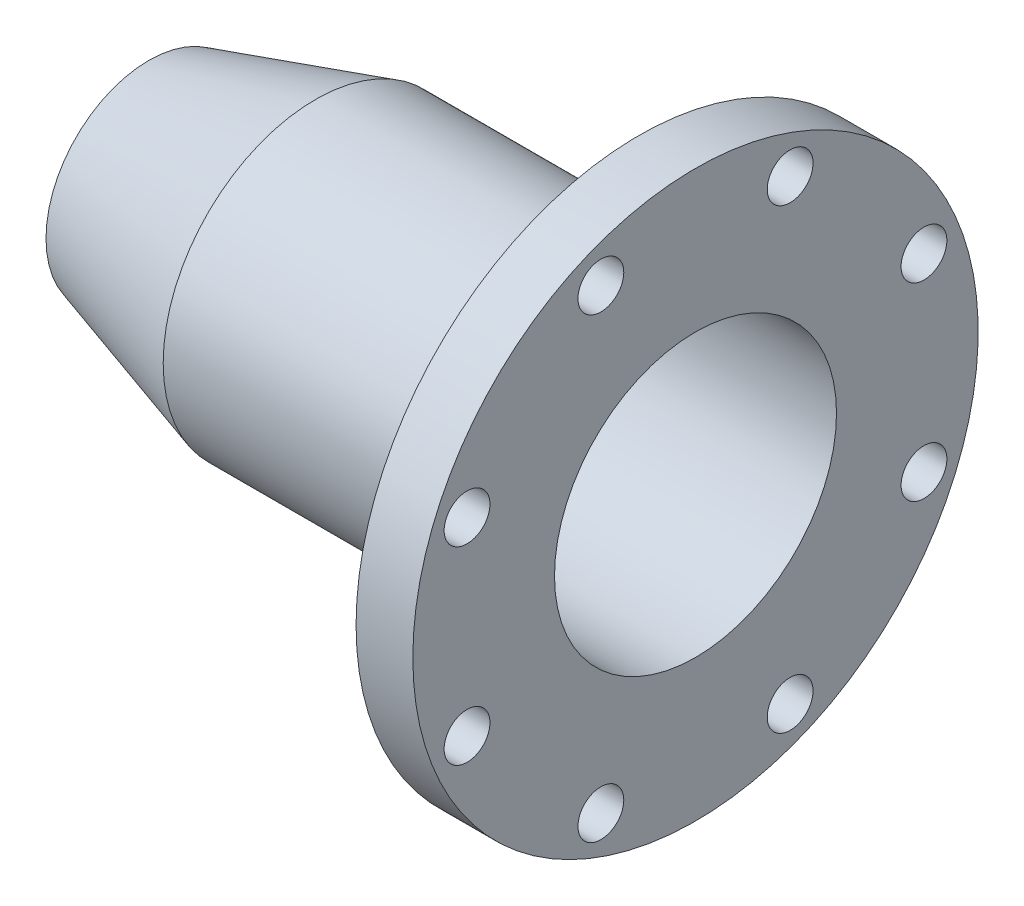
ISO-10303-21;
HEADER;
FILE_DESCRIPTION(('STEP AP214'),'2;1');
FILE_NAME('part.step','',(''),(''),'','','');
FILE_SCHEMA(('AUTOMOTIVE_DESIGN { 1 0 10303 214 1 1 1 1 }'));
ENDSEC;
DATA;
#1=APPLICATION_CONTEXT('core data for automotive mechanical design processes');
#2=APPLICATION_PROTOCOL_DEFINITION('international standard','automotive_design',2000,#1);
#3=PRODUCT_CONTEXT('',#1,'mechanical');
#4=PRODUCT('Part','Part','',(#3));
#5=PRODUCT_RELATED_PRODUCT_CATEGORY('part','',(#4));
#6=PRODUCT_DEFINITION_FORMATION('','',#4);
#7=PRODUCT_DEFINITION_CONTEXT('part definition',#1,'design');
#8=PRODUCT_DEFINITION('design','',#6,#7);
#9=PRODUCT_DEFINITION_SHAPE('','',#8);
#10=(LENGTH_UNIT() NAMED_UNIT(*) SI_UNIT(.MILLI.,.METRE.));
#11=(NAMED_UNIT(*) PLANE_ANGLE_UNIT() SI_UNIT($,.RADIAN.));
#12=(NAMED_UNIT(*) SI_UNIT($,.STERADIAN.) SOLID_ANGLE_UNIT());
#13=UNCERTAINTY_MEASURE_WITH_UNIT(LENGTH_MEASURE(1.E-05),#10,'distance_accuracy_value','');
#14=(GEOMETRIC_REPRESENTATION_CONTEXT(3) GLOBAL_UNCERTAINTY_ASSIGNED_CONTEXT((#13)) GLOBAL_UNIT_ASSIGNED_CONTEXT((#10,
#11,#12)) REPRESENTATION_CONTEXT('',''));
#15=CARTESIAN_POINT('',(0.,0.,0.));
#16=DIRECTION('',(0.,0.,1.));
#17=DIRECTION('',(1.,0.,0.));
#18=AXIS2_PLACEMENT_3D('',#15,#16,#17);
#19=CARTESIAN_POINT('',(0.,0.,0.));
#20=DIRECTION('',(-1.,0.,0.));
#21=DIRECTION('',(0.,0.,1.));
#22=AXIS2_PLACEMENT_3D('',#19,#20,#21);
#23=CYLINDRICAL_SURFACE('',#22,74.295);
#24=CARTESIAN_POINT('',(239.01,0.,0.));
#25=DIRECTION('',(-1.,0.,0.));
#26=DIRECTION('',(0.,0.,1.));
#27=AXIS2_PLACEMENT_3D('',#24,#25,#26);
#28=CIRCLE('',#27,74.295);
#29=CARTESIAN_POINT('',(239.01,0.,74.295));
#30=VERTEX_POINT('',#29);
#31=EDGE_CURVE('E88',#30,#30,#28,.T.);
#32=ORIENTED_EDGE('',*,*,#31,.T.);
#33=EDGE_LOOP('',(#32));
#34=FACE_BOUND('',#33,.T.);
#35=CARTESIAN_POINT('',(81.28,0.,0.));
#36=DIRECTION('',(-1.,0.,0.));
#37=DIRECTION('',(0.,0.,1.));
#38=AXIS2_PLACEMENT_3D('',#35,#36,#37);
#39=CIRCLE('',#38,74.295);
#40=CARTESIAN_POINT('',(81.28,0.,74.295));
#41=VERTEX_POINT('',#40);
#42=EDGE_CURVE('E10',#41,#41,#39,.T.);
#43=ORIENTED_EDGE('',*,*,#42,.F.);
#44=EDGE_LOOP('',(#43));
#45=FACE_BOUND('',#44,.T.);
#46=ADVANCED_FACE('F40',(#34,#45),#23,.T.);
#47=CARTESIAN_POINT('',(81.28,0.,0.));
#48=DIRECTION('',(1.,0.,0.));
#49=DIRECTION('',(0.,0.,-1.));
#50=AXIS2_PLACEMENT_3D('',#47,#48,#49);
#51=CONICAL_SURFACE('',#50,74.295,0.288340484549115);
#52=CARTESIAN_POINT('',(0.,0.,0.));
#53=DIRECTION('',(-1.,0.,0.));
#54=DIRECTION('',(0.,0.,1.));
#55=AXIS2_PLACEMENT_3D('',#52,#53,#54);
#56=CIRCLE('',#55,50.1868331198608);
#57=CARTESIAN_POINT('',(0.,0.,50.1868331198608));
#58=VERTEX_POINT('',#57);
#59=EDGE_CURVE('E47',#58,#58,#56,.T.);
#60=ORIENTED_EDGE('',*,*,#59,.F.);
#61=EDGE_LOOP('',(#60));
#62=FACE_BOUND('',#61,.T.);
#63=ORIENTED_EDGE('',*,*,#42,.T.);
#64=EDGE_LOOP('',(#63));
#65=FACE_BOUND('',#64,.T.);
#66=ADVANCED_FACE('F111',(#62,#65),#51,.T.);
#67=CARTESIAN_POINT('',(0.,0.,0.));
#68=DIRECTION('',(1.,0.,0.));
#69=DIRECTION('',(0.,0.,-1.));
#70=AXIS2_PLACEMENT_3D('',#67,#68,#69);
#71=PLANE('',#70);
#72=CARTESIAN_POINT('',(0.,0.,0.));
#73=DIRECTION('',(-1.,0.,0.));
#74=DIRECTION('',(0.,0.,1.));
#75=AXIS2_PLACEMENT_3D('',#72,#73,#74);
#76=CIRCLE('',#75,44.45);
#77=CARTESIAN_POINT('',(0.,0.,44.45));
#78=VERTEX_POINT('',#77);
#79=EDGE_CURVE('E52',#78,#78,#76,.T.);
#80=ORIENTED_EDGE('',*,*,#79,.F.);
#81=EDGE_LOOP('',(#80));
#82=FACE_BOUND('',#81,.T.);
#83=ORIENTED_EDGE('',*,*,#59,.T.);
#84=EDGE_LOOP('',(#83));
#85=FACE_BOUND('',#84,.T.);
#86=ADVANCED_FACE('F108',(#82,#85),#71,.F.);
#87=CARTESIAN_POINT('',(82.0784761378992,0.,0.));
#88=DIRECTION('',(1.,0.,0.));
#89=DIRECTION('',(0.,0.,-1.));
#90=AXIS2_PLACEMENT_3D('',#87,#88,#89);
#91=CONICAL_SURFACE('',#90,68.795,0.288340484549115);
#92=ORIENTED_EDGE('',*,*,#79,.T.);
#93=EDGE_LOOP('',(#92));
#94=FACE_BOUND('',#93,.T.);
#95=CARTESIAN_POINT('',(82.0784761378992,0.,0.));
#96=DIRECTION('',(-1.,0.,0.));
#97=DIRECTION('',(0.,0.,1.));
#98=AXIS2_PLACEMENT_3D('',#95,#96,#97);
#99=CIRCLE('',#98,68.795);
#100=CARTESIAN_POINT('',(82.0784761378992,0.,68.795));
#101=VERTEX_POINT('',#100);
#102=EDGE_CURVE('E100',#101,#101,#99,.T.);
#103=ORIENTED_EDGE('',*,*,#102,.F.);
#104=EDGE_LOOP('',(#103));
#105=FACE_BOUND('',#104,.T.);
#106=ADVANCED_FACE('F105',(#94,#105),#91,.F.);
#107=CARTESIAN_POINT('',(0.,0.,0.));
#108=DIRECTION('',(-1.,0.,0.));
#109=DIRECTION('',(0.,0.,1.));
#110=AXIS2_PLACEMENT_3D('',#107,#108,#109);
#111=CYLINDRICAL_SURFACE('',#110,68.795);
#112=ORIENTED_EDGE('',*,*,#102,.T.);
#113=EDGE_LOOP('',(#112));
#114=FACE_BOUND('',#113,.T.);
#115=CARTESIAN_POINT('',(266.7,0.,0.));
#116=DIRECTION('',(-1.,0.,0.));
#117=DIRECTION('',(0.,0.,1.));
#118=AXIS2_PLACEMENT_3D('',#115,#116,#117);
#119=CIRCLE('',#118,68.795);
#120=CARTESIAN_POINT('',(266.7,0.,68.795));
#121=VERTEX_POINT('',#120);
#122=EDGE_CURVE('E97',#121,#121,#119,.T.);
#123=ORIENTED_EDGE('',*,*,#122,.F.);
#124=EDGE_LOOP('',(#123));
#125=FACE_BOUND('',#124,.T.);
#126=ADVANCED_FACE('F123',(#114,#125),#111,.F.);
#127=CARTESIAN_POINT('',(266.7,2.141746695606E-13,0.));
#128=DIRECTION('',(-1.,0.,0.));
#129=DIRECTION('',(0.,0.,1.));
#130=AXIS2_PLACEMENT_3D('',#127,#128,#129);
#131=PLANE('',#130);
#132=CARTESIAN_POINT('',(266.7,46.1707561148491,111.466065597486));
#133=DIRECTION('',(1.,0.,0.));
#134=DIRECTION('',(0.,0.,-1.));
#135=AXIS2_PLACEMENT_3D('',#132,#133,#134);
#136=CIRCLE('',#135,11.176);
#137=CARTESIAN_POINT('',(266.7,46.1707561148491,100.290065597486));
#138=VERTEX_POINT('',#137);
#139=EDGE_CURVE('E174',#138,#138,#136,.T.);
#140=ORIENTED_EDGE('',*,*,#139,.F.);
#141=EDGE_LOOP('',(#140));
#142=FACE_BOUND('',#141,.T.);
#143=CARTESIAN_POINT('',(266.7,-46.1707561148473,111.466065597487));
#144=DIRECTION('',(1.,0.,0.));
#145=DIRECTION('',(0.,0.,-1.));
#146=AXIS2_PLACEMENT_3D('',#143,#144,#145);
#147=CIRCLE('',#146,11.176);
#148=CARTESIAN_POINT('',(266.7,-46.1707561148473,100.290065597487));
#149=VERTEX_POINT('',#148);
#150=EDGE_CURVE('E178',#149,#149,#147,.T.);
#151=ORIENTED_EDGE('',*,*,#150,.F.);
#152=EDGE_LOOP('',(#151));
#153=FACE_BOUND('',#152,.T.);
#154=CARTESIAN_POINT('',(266.7,-111.466065597486,46.1707561148487));
#155=DIRECTION('',(1.,0.,0.));
#156=DIRECTION('',(0.,0.,-1.));
#157=AXIS2_PLACEMENT_3D('',#154,#155,#156);
#158=CIRCLE('',#157,11.176);
#159=CARTESIAN_POINT('',(266.7,-111.466065597486,34.9947561148488));
#160=VERTEX_POINT('',#159);
#161=EDGE_CURVE('E187',#160,#160,#158,.T.);
#162=ORIENTED_EDGE('',*,*,#161,.F.);
#163=EDGE_LOOP('',(#162));
#164=FACE_BOUND('',#163,.T.);
#165=CARTESIAN_POINT('',(266.7,-111.466065597487,-46.1707561148476));
#166=DIRECTION('',(1.,0.,0.));
#167=DIRECTION('',(0.,0.,-1.));
#168=AXIS2_PLACEMENT_3D('',#165,#166,#167);
#169=CIRCLE('',#168,11.176);
#170=CARTESIAN_POINT('',(266.7,-111.466065597487,-57.3467561148475));
#171=VERTEX_POINT('',#170);
#172=EDGE_CURVE('E77',#171,#171,#169,.T.);
#173=ORIENTED_EDGE('',*,*,#172,.F.);
#174=EDGE_LOOP('',(#173));
#175=FACE_BOUND('',#174,.T.);
#176=CARTESIAN_POINT('',(266.7,-46.1707561148484,-111.466065597487));
#177=DIRECTION('',(1.,0.,0.));
#178=DIRECTION('',(0.,0.,-1.));
#179=AXIS2_PLACEMENT_3D('',#176,#177,#178);
#180=CIRCLE('',#179,11.176);
#181=CARTESIAN_POINT('',(266.7,-46.1707561148484,-122.642065597487));
#182=VERTEX_POINT('',#181);
#183=EDGE_CURVE('E66',#182,#182,#180,.T.);
#184=ORIENTED_EDGE('',*,*,#183,.F.);
#185=EDGE_LOOP('',(#184));
#186=FACE_BOUND('',#185,.T.);
#187=CARTESIAN_POINT('',(266.7,46.1707561148479,-111.466065597487));
#188=DIRECTION('',(1.,0.,0.));
#189=DIRECTION('',(0.,0.,-1.));
#190=AXIS2_PLACEMENT_3D('',#187,#188,#189);
#191=CIRCLE('',#190,11.176);
#192=CARTESIAN_POINT('',(266.7,46.1707561148479,-122.642065597487));
#193=VERTEX_POINT('',#192);
#194=EDGE_CURVE('E63',#193,#193,#191,.T.);
#195=ORIENTED_EDGE('',*,*,#194,.F.);
#196=EDGE_LOOP('',(#195));
#197=FACE_BOUND('',#196,.T.);
#198=CARTESIAN_POINT('',(266.7,111.466065597487,-46.1707561148481));
#199=DIRECTION('',(1.,0.,0.));
#200=DIRECTION('',(0.,0.,-1.));
#201=AXIS2_PLACEMENT_3D('',#198,#199,#200);
#202=CIRCLE('',#201,11.176);
#203=CARTESIAN_POINT('',(266.7,111.466065597487,-57.3467561148481));
#204=VERTEX_POINT('',#203);
#205=EDGE_CURVE('E60',#204,#204,#202,.T.);
#206=ORIENTED_EDGE('',*,*,#205,.F.);
#207=EDGE_LOOP('',(#206));
#208=FACE_BOUND('',#207,.T.);
#209=CARTESIAN_POINT('',(266.7,111.466065597487,46.1707561148482));
#210=DIRECTION('',(1.,0.,0.));
#211=DIRECTION('',(0.,0.,-1.));
#212=AXIS2_PLACEMENT_3D('',#209,#210,#211);
#213=CIRCLE('',#212,11.176);
#214=CARTESIAN_POINT('',(266.7,111.466065597487,34.9947561148482));
#215=VERTEX_POINT('',#214);
#216=EDGE_CURVE('E59',#215,#215,#213,.T.);
#217=ORIENTED_EDGE('',*,*,#216,.F.);
#218=EDGE_LOOP('',(#217));
#219=FACE_BOUND('',#218,.T.);
#220=CARTESIAN_POINT('',(266.7,0.,0.));
#221=DIRECTION('',(-1.,0.,0.));
#222=DIRECTION('',(0.,0.,1.));
#223=AXIS2_PLACEMENT_3D('',#220,#221,#222);
#224=CIRCLE('',#223,137.92);
#225=CARTESIAN_POINT('',(266.7,0.,137.92));
#226=VERTEX_POINT('',#225);
#227=EDGE_CURVE('E94',#226,#226,#224,.T.);
#228=ORIENTED_EDGE('',*,*,#227,.F.);
#229=EDGE_LOOP('',(#228));
#230=FACE_BOUND('',#229,.T.);
#231=ORIENTED_EDGE('',*,*,#122,.T.);
#232=EDGE_LOOP('',(#231));
#233=FACE_BOUND('',#232,.T.);
#234=ADVANCED_FACE('F126',(#142,#153,#164,#175,#186,#197,#208,#219,#230,#233),#131,.F.);
#235=CARTESIAN_POINT('',(0.,0.,0.));
#236=DIRECTION('',(-1.,0.,0.));
#237=DIRECTION('',(0.,0.,1.));
#238=AXIS2_PLACEMENT_3D('',#235,#236,#237);
#239=CYLINDRICAL_SURFACE('',#238,137.92);
#240=CARTESIAN_POINT('',(239.01,0.,0.));
#241=DIRECTION('',(-1.,0.,0.));
#242=DIRECTION('',(0.,0.,1.));
#243=AXIS2_PLACEMENT_3D('',#240,#241,#242);
#244=CIRCLE('',#243,137.92);
#245=CARTESIAN_POINT('',(239.01,0.,137.92));
#246=VERTEX_POINT('',#245);
#247=EDGE_CURVE('E91',#246,#246,#244,.T.);
#248=ORIENTED_EDGE('',*,*,#247,.F.);
#249=EDGE_LOOP('',(#248));
#250=FACE_BOUND('',#249,.T.);
#251=ORIENTED_EDGE('',*,*,#227,.T.);
#252=EDGE_LOOP('',(#251));
#253=FACE_BOUND('',#252,.T.);
#254=ADVANCED_FACE('F130',(#250,#253),#239,.T.);
#255=CARTESIAN_POINT('',(239.01,1.04264992186899E-13,0.));
#256=DIRECTION('',(1.,0.,0.));
#257=DIRECTION('',(0.,0.,-1.));
#258=AXIS2_PLACEMENT_3D('',#255,#256,#257);
#259=PLANE('',#258);
#260=CARTESIAN_POINT('',(239.01,46.1707561148491,111.466065597486));
#261=DIRECTION('',(1.,0.,0.));
#262=DIRECTION('',(0.,0.,-1.));
#263=AXIS2_PLACEMENT_3D('',#260,#261,#262);
#264=CIRCLE('',#263,11.176);
#265=CARTESIAN_POINT('',(239.01,46.1707561148491,100.290065597486));
#266=VERTEX_POINT('',#265);
#267=EDGE_CURVE('E177',#266,#266,#264,.T.);
#268=ORIENTED_EDGE('',*,*,#267,.T.);
#269=EDGE_LOOP('',(#268));
#270=FACE_BOUND('',#269,.T.);
#271=CARTESIAN_POINT('',(239.01,-46.1707561148473,111.466065597487));
#272=DIRECTION('',(1.,0.,0.));
#273=DIRECTION('',(0.,0.,-1.));
#274=AXIS2_PLACEMENT_3D('',#271,#272,#273);
#275=CIRCLE('',#274,11.176);
#276=CARTESIAN_POINT('',(239.01,-46.1707561148473,100.290065597487));
#277=VERTEX_POINT('',#276);
#278=EDGE_CURVE('E181',#277,#277,#275,.T.);
#279=ORIENTED_EDGE('',*,*,#278,.T.);
#280=EDGE_LOOP('',(#279));
#281=FACE_BOUND('',#280,.T.);
#282=CARTESIAN_POINT('',(239.01,-111.466065597486,46.1707561148487));
#283=DIRECTION('',(1.,0.,0.));
#284=DIRECTION('',(0.,0.,-1.));
#285=AXIS2_PLACEMENT_3D('',#282,#283,#284);
#286=CIRCLE('',#285,11.176);
#287=CARTESIAN_POINT('',(239.01,-111.466065597486,34.9947561148488));
#288=VERTEX_POINT('',#287);
#289=EDGE_CURVE('E43',#288,#288,#286,.T.);
#290=ORIENTED_EDGE('',*,*,#289,.T.);
#291=EDGE_LOOP('',(#290));
#292=FACE_BOUND('',#291,.T.);
#293=CARTESIAN_POINT('',(239.01,-111.466065597487,-46.1707561148476));
#294=DIRECTION('',(1.,0.,0.));
#295=DIRECTION('',(0.,0.,-1.));
#296=AXIS2_PLACEMENT_3D('',#293,#294,#295);
#297=CIRCLE('',#296,11.176);
#298=CARTESIAN_POINT('',(239.01,-111.466065597487,-57.3467561148475));
#299=VERTEX_POINT('',#298);
#300=EDGE_CURVE('E72',#299,#299,#297,.T.);
#301=ORIENTED_EDGE('',*,*,#300,.T.);
#302=EDGE_LOOP('',(#301));
#303=FACE_BOUND('',#302,.T.);
#304=CARTESIAN_POINT('',(239.01,-46.1707561148484,-111.466065597487));
#305=DIRECTION('',(1.,0.,0.));
#306=DIRECTION('',(0.,0.,-1.));
#307=AXIS2_PLACEMENT_3D('',#304,#305,#306);
#308=CIRCLE('',#307,11.176);
#309=CARTESIAN_POINT('',(239.01,-46.1707561148484,-122.642065597487));
#310=VERTEX_POINT('',#309);
#311=EDGE_CURVE('E64',#310,#310,#308,.T.);
#312=ORIENTED_EDGE('',*,*,#311,.T.);
#313=EDGE_LOOP('',(#312));
#314=FACE_BOUND('',#313,.T.);
#315=CARTESIAN_POINT('',(239.01,46.1707561148479,-111.466065597487));
#316=DIRECTION('',(1.,0.,0.));
#317=DIRECTION('',(0.,0.,-1.));
#318=AXIS2_PLACEMENT_3D('',#315,#316,#317);
#319=CIRCLE('',#318,11.176);
#320=CARTESIAN_POINT('',(239.01,46.1707561148479,-122.642065597487));
#321=VERTEX_POINT('',#320);
#322=EDGE_CURVE('E61',#321,#321,#319,.T.);
#323=ORIENTED_EDGE('',*,*,#322,.T.);
#324=EDGE_LOOP('',(#323));
#325=FACE_BOUND('',#324,.T.);
#326=CARTESIAN_POINT('',(239.01,111.466065597487,-46.1707561148481));
#327=DIRECTION('',(1.,0.,0.));
#328=DIRECTION('',(0.,0.,-1.));
#329=AXIS2_PLACEMENT_3D('',#326,#327,#328);
#330=CIRCLE('',#329,11.176);
#331=CARTESIAN_POINT('',(239.01,111.466065597487,-57.3467561148481));
#332=VERTEX_POINT('',#331);
#333=EDGE_CURVE('E56',#332,#332,#330,.T.);
#334=ORIENTED_EDGE('',*,*,#333,.T.);
#335=EDGE_LOOP('',(#334));
#336=FACE_BOUND('',#335,.T.);
#337=CARTESIAN_POINT('',(239.01,111.466065597487,46.1707561148482));
#338=DIRECTION('',(1.,0.,0.));
#339=DIRECTION('',(0.,0.,-1.));
#340=AXIS2_PLACEMENT_3D('',#337,#338,#339);
#341=CIRCLE('',#340,11.176);
#342=CARTESIAN_POINT('',(239.01,111.466065597487,34.9947561148482));
#343=VERTEX_POINT('',#342);
#344=EDGE_CURVE('E85',#343,#343,#341,.T.);
#345=ORIENTED_EDGE('',*,*,#344,.T.);
#346=EDGE_LOOP('',(#345));
#347=FACE_BOUND('',#346,.T.);
#348=ORIENTED_EDGE('',*,*,#31,.F.);
#349=EDGE_LOOP('',(#348));
#350=FACE_BOUND('',#349,.T.);
#351=ORIENTED_EDGE('',*,*,#247,.T.);
#352=EDGE_LOOP('',(#351));
#353=FACE_BOUND('',#352,.T.);
#354=ADVANCED_FACE('F134',(#270,#281,#292,#303,#314,#325,#336,#347,#350,#353),#259,.F.);
#355=CARTESIAN_POINT('',(266.7,111.466065597487,46.1707561148482));
#356=DIRECTION('',(1.,0.,0.));
#357=DIRECTION('',(0.,0.,-1.));
#358=AXIS2_PLACEMENT_3D('',#355,#356,#357);
#359=CYLINDRICAL_SURFACE('',#358,11.176);
#360=ORIENTED_EDGE('',*,*,#216,.T.);
#361=EDGE_LOOP('',(#360));
#362=FACE_BOUND('',#361,.T.);
#363=ORIENTED_EDGE('',*,*,#344,.F.);
#364=EDGE_LOOP('',(#363));
#365=FACE_BOUND('',#364,.T.);
#366=ADVANCED_FACE('F138',(#362,#365),#359,.F.);
#367=CARTESIAN_POINT('',(266.7,111.466065597487,-46.1707561148481));
#368=DIRECTION('',(1.,0.,0.));
#369=DIRECTION('',(0.,0.,-1.));
#370=AXIS2_PLACEMENT_3D('',#367,#368,#369);
#371=CYLINDRICAL_SURFACE('',#370,11.176);
#372=ORIENTED_EDGE('',*,*,#205,.T.);
#373=EDGE_LOOP('',(#372));
#374=FACE_BOUND('',#373,.T.);
#375=ORIENTED_EDGE('',*,*,#333,.F.);
#376=EDGE_LOOP('',(#375));
#377=FACE_BOUND('',#376,.T.);
#378=ADVANCED_FACE('F142',(#374,#377),#371,.F.);
#379=CARTESIAN_POINT('',(266.7,46.1707561148479,-111.466065597487));
#380=DIRECTION('',(1.,0.,0.));
#381=DIRECTION('',(0.,0.,-1.));
#382=AXIS2_PLACEMENT_3D('',#379,#380,#381);
#383=CYLINDRICAL_SURFACE('',#382,11.176);
#384=ORIENTED_EDGE('',*,*,#194,.T.);
#385=EDGE_LOOP('',(#384));
#386=FACE_BOUND('',#385,.T.);
#387=ORIENTED_EDGE('',*,*,#322,.F.);
#388=EDGE_LOOP('',(#387));
#389=FACE_BOUND('',#388,.T.);
#390=ADVANCED_FACE('F146',(#386,#389),#383,.F.);
#391=CARTESIAN_POINT('',(266.7,-46.1707561148484,-111.466065597487));
#392=DIRECTION('',(1.,0.,0.));
#393=DIRECTION('',(0.,0.,-1.));
#394=AXIS2_PLACEMENT_3D('',#391,#392,#393);
#395=CYLINDRICAL_SURFACE('',#394,11.176);
#396=ORIENTED_EDGE('',*,*,#183,.T.);
#397=EDGE_LOOP('',(#396));
#398=FACE_BOUND('',#397,.T.);
#399=ORIENTED_EDGE('',*,*,#311,.F.);
#400=EDGE_LOOP('',(#399));
#401=FACE_BOUND('',#400,.T.);
#402=ADVANCED_FACE('F150',(#398,#401),#395,.F.);
#403=CARTESIAN_POINT('',(266.7,-111.466065597487,-46.1707561148476));
#404=DIRECTION('',(1.,0.,0.));
#405=DIRECTION('',(0.,0.,-1.));
#406=AXIS2_PLACEMENT_3D('',#403,#404,#405);
#407=CYLINDRICAL_SURFACE('',#406,11.176);
#408=ORIENTED_EDGE('',*,*,#172,.T.);
#409=EDGE_LOOP('',(#408));
#410=FACE_BOUND('',#409,.T.);
#411=ORIENTED_EDGE('',*,*,#300,.F.);
#412=EDGE_LOOP('',(#411));
#413=FACE_BOUND('',#412,.T.);
#414=ADVANCED_FACE('F154',(#410,#413),#407,.F.);
#415=CARTESIAN_POINT('',(266.7,-111.466065597486,46.1707561148487));
#416=DIRECTION('',(1.,0.,0.));
#417=DIRECTION('',(0.,0.,-1.));
#418=AXIS2_PLACEMENT_3D('',#415,#416,#417);
#419=CYLINDRICAL_SURFACE('',#418,11.176);
#420=ORIENTED_EDGE('',*,*,#161,.T.);
#421=EDGE_LOOP('',(#420));
#422=FACE_BOUND('',#421,.T.);
#423=ORIENTED_EDGE('',*,*,#289,.F.);
#424=EDGE_LOOP('',(#423));
#425=FACE_BOUND('',#424,.T.);
#426=ADVANCED_FACE('F157',(#422,#425),#419,.F.);
#427=CARTESIAN_POINT('',(266.7,-46.1707561148473,111.466065597487));
#428=DIRECTION('',(1.,0.,0.));
#429=DIRECTION('',(0.,0.,-1.));
#430=AXIS2_PLACEMENT_3D('',#427,#428,#429);
#431=CYLINDRICAL_SURFACE('',#430,11.176);
#432=ORIENTED_EDGE('',*,*,#150,.T.);
#433=EDGE_LOOP('',(#432));
#434=FACE_BOUND('',#433,.T.);
#435=ORIENTED_EDGE('',*,*,#278,.F.);
#436=EDGE_LOOP('',(#435));
#437=FACE_BOUND('',#436,.T.);
#438=ADVANCED_FACE('F161',(#434,#437),#431,.F.);
#439=CARTESIAN_POINT('',(266.7,46.1707561148491,111.466065597486));
#440=DIRECTION('',(1.,0.,0.));
#441=DIRECTION('',(0.,0.,-1.));
#442=AXIS2_PLACEMENT_3D('',#439,#440,#441);
#443=CYLINDRICAL_SURFACE('',#442,11.176);
#444=ORIENTED_EDGE('',*,*,#139,.T.);
#445=EDGE_LOOP('',(#444));
#446=FACE_BOUND('',#445,.T.);
#447=ORIENTED_EDGE('',*,*,#267,.F.);
#448=EDGE_LOOP('',(#447));
#449=FACE_BOUND('',#448,.T.);
#450=ADVANCED_FACE('F165',(#446,#449),#443,.F.);
#451=CLOSED_SHELL('',(#46,#66,#86,#106,#126,#234,#254,#354,#366,#378,#390,#402,#414,#426,#438,#450));
#452=MANIFOLD_SOLID_BREP('B2',#451);
#453=ADVANCED_BREP_SHAPE_REPRESENTATION('',(#18,#452),#14);
#454=SHAPE_DEFINITION_REPRESENTATION(#9,#453);
ENDSEC;
END-ISO-10303-21;
